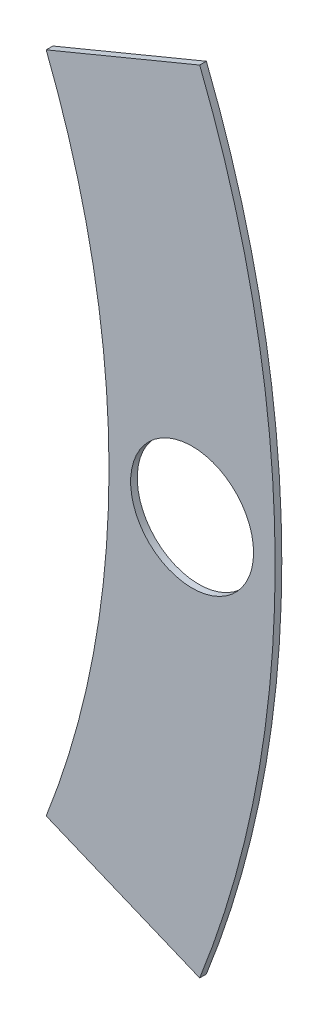
ISO-10303-21;
HEADER;
FILE_DESCRIPTION(('STEP AP214'),'2;1');
FILE_NAME('part.step','',(''),(''),'','','');
FILE_SCHEMA(('AUTOMOTIVE_DESIGN { 1 0 10303 214 1 1 1 1 }'));
ENDSEC;
DATA;
#1=APPLICATION_CONTEXT('core data for automotive mechanical design processes');
#2=APPLICATION_PROTOCOL_DEFINITION('international standard','automotive_design',2000,#1);
#3=PRODUCT_CONTEXT('',#1,'mechanical');
#4=PRODUCT('Part','Part','',(#3));
#5=PRODUCT_RELATED_PRODUCT_CATEGORY('part','',(#4));
#6=PRODUCT_DEFINITION_FORMATION('','',#4);
#7=PRODUCT_DEFINITION_CONTEXT('part definition',#1,'design');
#8=PRODUCT_DEFINITION('design','',#6,#7);
#9=PRODUCT_DEFINITION_SHAPE('','',#8);
#10=(LENGTH_UNIT() NAMED_UNIT(*) SI_UNIT(.MILLI.,.METRE.));
#11=(NAMED_UNIT(*) PLANE_ANGLE_UNIT() SI_UNIT($,.RADIAN.));
#12=(NAMED_UNIT(*) SI_UNIT($,.STERADIAN.) SOLID_ANGLE_UNIT());
#13=UNCERTAINTY_MEASURE_WITH_UNIT(LENGTH_MEASURE(1.E-05),#10,'distance_accuracy_value','');
#14=(GEOMETRIC_REPRESENTATION_CONTEXT(3) GLOBAL_UNCERTAINTY_ASSIGNED_CONTEXT((#13)) GLOBAL_UNIT_ASSIGNED_CONTEXT((#10,
#11,#12)) REPRESENTATION_CONTEXT('',''));
#15=CARTESIAN_POINT('',(0.,0.,0.));
#16=DIRECTION('',(0.,0.,1.));
#17=DIRECTION('',(1.,0.,0.));
#18=AXIS2_PLACEMENT_3D('',#15,#16,#17);
#19=CARTESIAN_POINT('',(0.,0.,0.508));
#20=DIRECTION('',(0.,0.,-1.));
#21=DIRECTION('',(-1.,0.,0.));
#22=AXIS2_PLACEMENT_3D('',#19,#20,#21);
#23=CYLINDRICAL_SURFACE('',#22,82.042);
#24=DIRECTION('',(0.,0.,1.));
#25=VECTOR('',#24,1.);
#26=CARTESIAN_POINT('',(76.2738505429117,-30.2190252549212,0.));
#27=LINE('',#26,#25);
#28=CARTESIAN_POINT('',(76.2738505429117,-30.2190252549212,0.));
#29=VERTEX_POINT('',#28);
#30=CARTESIAN_POINT('',(76.2738505429117,-30.2190252549212,0.508));
#31=VERTEX_POINT('',#30);
#32=EDGE_CURVE('E92',#29,#31,#27,.T.);
#33=ORIENTED_EDGE('',*,*,#32,.F.);
#34=CARTESIAN_POINT('',(0.,0.,0.));
#35=DIRECTION('',(0.,0.,1.));
#36=DIRECTION('',(1.,0.,0.));
#37=AXIS2_PLACEMENT_3D('',#34,#35,#36);
#38=CIRCLE('',#37,82.042);
#39=CARTESIAN_POINT('',(76.2738505429117,30.2190252549212,0.));
#40=VERTEX_POINT('',#39);
#41=EDGE_CURVE('E38',#29,#40,#38,.T.);
#42=ORIENTED_EDGE('',*,*,#41,.T.);
#43=DIRECTION('',(0.,0.,1.));
#44=VECTOR('',#43,1.);
#45=CARTESIAN_POINT('',(76.2738505429117,30.2190252549212,0.));
#46=LINE('',#45,#44);
#47=CARTESIAN_POINT('',(76.2738505429117,30.2190252549212,0.508));
#48=VERTEX_POINT('',#47);
#49=EDGE_CURVE('E73',#40,#48,#46,.T.);
#50=ORIENTED_EDGE('',*,*,#49,.T.);
#51=CARTESIAN_POINT('',(0.,0.,0.508));
#52=DIRECTION('',(0.,0.,1.));
#53=DIRECTION('',(1.,0.,0.));
#54=AXIS2_PLACEMENT_3D('',#51,#52,#53);
#55=CIRCLE('',#54,82.042);
#56=EDGE_CURVE('E12',#31,#48,#55,.T.);
#57=ORIENTED_EDGE('',*,*,#56,.F.);
#58=EDGE_LOOP('',(#33,#42,#50,#57));
#59=FACE_BOUND('',#58,.T.);
#60=ADVANCED_FACE('F35',(#59),#23,.T.);
#61=CARTESIAN_POINT('',(0.,0.,0.508));
#62=DIRECTION('',(0.,0.,1.));
#63=DIRECTION('',(1.,0.,0.));
#64=AXIS2_PLACEMENT_3D('',#61,#62,#63);
#65=PLANE('',#64);
#66=CARTESIAN_POINT('',(75.692,0.,0.508));
#67=DIRECTION('',(0.,0.,1.));
#68=DIRECTION('',(1.,0.,0.));
#69=AXIS2_PLACEMENT_3D('',#66,#67,#68);
#70=CIRCLE('',#69,4.69899999999999);
#71=CARTESIAN_POINT('',(80.391,0.,0.508));
#72=VERTEX_POINT('',#71);
#73=EDGE_CURVE('E99',#72,#72,#70,.T.);
#74=ORIENTED_EDGE('',*,*,#73,.F.);
#75=EDGE_LOOP('',(#74));
#76=FACE_BOUND('',#75,.T.);
#77=CARTESIAN_POINT('',(0.,0.,0.508));
#78=DIRECTION('',(0.,0.,1.));
#79=DIRECTION('',(1.,0.,0.));
#80=AXIS2_PLACEMENT_3D('',#77,#78,#79);
#81=CIRCLE('',#80,69.342);
#82=CARTESIAN_POINT('',(64.5389168484906,-25.358256565143,0.508));
#83=VERTEX_POINT('',#82);
#84=CARTESIAN_POINT('',(64.5389168484906,25.358256565143,0.508));
#85=VERTEX_POINT('',#84);
#86=EDGE_CURVE('E93',#83,#85,#81,.T.);
#87=ORIENTED_EDGE('',*,*,#86,.F.);
#88=DIRECTION('',(0.923879532511286,-0.382683432365091,0.));
#89=VECTOR('',#88,1.);
#90=CARTESIAN_POINT('',(64.5389168484906,-25.358256565143,0.508));
#91=LINE('',#90,#89);
#92=EDGE_CURVE('E49',#83,#31,#91,.T.);
#93=ORIENTED_EDGE('',*,*,#92,.T.);
#94=ORIENTED_EDGE('',*,*,#56,.T.);
#95=DIRECTION('',(-0.923879532511286,-0.38268343236509,0.));
#96=VECTOR('',#95,1.);
#97=CARTESIAN_POINT('',(64.5389168484906,25.358256565143,0.508));
#98=LINE('',#97,#96);
#99=EDGE_CURVE('E76',#48,#85,#98,.T.);
#100=ORIENTED_EDGE('',*,*,#99,.T.);
#101=EDGE_LOOP('',(#87,#93,#94,#100));
#102=FACE_BOUND('',#101,.T.);
#103=ADVANCED_FACE('F115',(#76,#102),#65,.T.);
#104=CARTESIAN_POINT('',(0.,0.,0.));
#105=DIRECTION('',(0.,0.,1.));
#106=DIRECTION('',(1.,0.,0.));
#107=AXIS2_PLACEMENT_3D('',#104,#105,#106);
#108=PLANE('',#107);
#109=CARTESIAN_POINT('',(75.692,0.,0.));
#110=DIRECTION('',(0.,0.,1.));
#111=DIRECTION('',(1.,0.,0.));
#112=AXIS2_PLACEMENT_3D('',#109,#110,#111);
#113=CIRCLE('',#112,4.69899999999999);
#114=CARTESIAN_POINT('',(80.391,0.,0.));
#115=VERTEX_POINT('',#114);
#116=EDGE_CURVE('E96',#115,#115,#113,.T.);
#117=ORIENTED_EDGE('',*,*,#116,.T.);
#118=EDGE_LOOP('',(#117));
#119=FACE_BOUND('',#118,.T.);
#120=DIRECTION('',(0.923879532511286,-0.382683432365091,0.));
#121=VECTOR('',#120,1.);
#122=CARTESIAN_POINT('',(64.5389168484906,-25.358256565143,0.));
#123=LINE('',#122,#121);
#124=CARTESIAN_POINT('',(64.5389168484906,-25.358256565143,0.));
#125=VERTEX_POINT('',#124);
#126=EDGE_CURVE('E81',#125,#29,#123,.T.);
#127=ORIENTED_EDGE('',*,*,#126,.F.);
#128=CARTESIAN_POINT('',(0.,0.,0.));
#129=DIRECTION('',(0.,0.,1.));
#130=DIRECTION('',(1.,0.,0.));
#131=AXIS2_PLACEMENT_3D('',#128,#129,#130);
#132=CIRCLE('',#131,69.342);
#133=CARTESIAN_POINT('',(64.5389168484906,25.358256565143,0.));
#134=VERTEX_POINT('',#133);
#135=EDGE_CURVE('E89',#125,#134,#132,.T.);
#136=ORIENTED_EDGE('',*,*,#135,.T.);
#137=DIRECTION('',(-0.923879532511286,-0.38268343236509,0.));
#138=VECTOR('',#137,1.);
#139=CARTESIAN_POINT('',(64.5389168484906,25.358256565143,0.));
#140=LINE('',#139,#138);
#141=EDGE_CURVE('E57',#40,#134,#140,.T.);
#142=ORIENTED_EDGE('',*,*,#141,.F.);
#143=ORIENTED_EDGE('',*,*,#41,.F.);
#144=EDGE_LOOP('',(#127,#136,#142,#143));
#145=FACE_BOUND('',#144,.T.);
#146=ADVANCED_FACE('F87',(#119,#145),#108,.F.);
#147=CARTESIAN_POINT('',(0.,0.,0.));
#148=DIRECTION('',(0.,0.,1.));
#149=DIRECTION('',(1.,0.,0.));
#150=AXIS2_PLACEMENT_3D('',#147,#148,#149);
#151=CYLINDRICAL_SURFACE('',#150,69.342);
#152=DIRECTION('',(0.,0.,1.));
#153=VECTOR('',#152,1.);
#154=CARTESIAN_POINT('',(64.5389168484906,-25.358256565143,0.));
#155=LINE('',#154,#153);
#156=EDGE_CURVE('E105',#125,#83,#155,.T.);
#157=ORIENTED_EDGE('',*,*,#156,.T.);
#158=ORIENTED_EDGE('',*,*,#86,.T.);
#159=DIRECTION('',(0.,0.,1.));
#160=VECTOR('',#159,1.);
#161=CARTESIAN_POINT('',(64.5389168484906,25.358256565143,0.));
#162=LINE('',#161,#160);
#163=EDGE_CURVE('E80',#134,#85,#162,.T.);
#164=ORIENTED_EDGE('',*,*,#163,.F.);
#165=ORIENTED_EDGE('',*,*,#135,.F.);
#166=EDGE_LOOP('',(#157,#158,#164,#165));
#167=FACE_BOUND('',#166,.T.);
#168=ADVANCED_FACE('F112',(#167),#151,.F.);
#169=CARTESIAN_POINT('',(75.692,0.,0.));
#170=DIRECTION('',(0.,0.,1.));
#171=DIRECTION('',(1.,0.,0.));
#172=AXIS2_PLACEMENT_3D('',#169,#170,#171);
#173=CYLINDRICAL_SURFACE('',#172,4.69899999999999);
#174=ORIENTED_EDGE('',*,*,#116,.F.);
#175=EDGE_LOOP('',(#174));
#176=FACE_BOUND('',#175,.T.);
#177=ORIENTED_EDGE('',*,*,#73,.T.);
#178=EDGE_LOOP('',(#177));
#179=FACE_BOUND('',#178,.T.);
#180=ADVANCED_FACE('F128',(#176,#179),#173,.F.);
#181=CARTESIAN_POINT('',(64.5389168484906,25.358256565143,0.));
#182=DIRECTION('',(-0.38268343236509,0.923879532511287,0.));
#183=DIRECTION('',(-0.923879532511287,-0.38268343236509,0.));
#184=AXIS2_PLACEMENT_3D('',#181,#182,#183);
#185=PLANE('',#184);
#186=ORIENTED_EDGE('',*,*,#99,.F.);
#187=ORIENTED_EDGE('',*,*,#49,.F.);
#188=ORIENTED_EDGE('',*,*,#141,.T.);
#189=ORIENTED_EDGE('',*,*,#163,.T.);
#190=EDGE_LOOP('',(#186,#187,#188,#189));
#191=FACE_BOUND('',#190,.T.);
#192=ADVANCED_FACE('F74',(#191),#185,.T.);
#193=CARTESIAN_POINT('',(64.5389168484906,-25.358256565143,0.));
#194=DIRECTION('',(-0.382683432365091,-0.923879532511287,0.));
#195=DIRECTION('',(0.923879532511287,-0.382683432365091,0.));
#196=AXIS2_PLACEMENT_3D('',#193,#194,#195);
#197=PLANE('',#196);
#198=ORIENTED_EDGE('',*,*,#92,.F.);
#199=ORIENTED_EDGE('',*,*,#156,.F.);
#200=ORIENTED_EDGE('',*,*,#126,.T.);
#201=ORIENTED_EDGE('',*,*,#32,.T.);
#202=EDGE_LOOP('',(#198,#199,#200,#201));
#203=FACE_BOUND('',#202,.T.);
#204=ADVANCED_FACE('F110',(#203),#197,.T.);
#205=CLOSED_SHELL('',(#60,#103,#146,#168,#180,#192,#204));
#206=MANIFOLD_SOLID_BREP('B2',#205);
#207=ADVANCED_BREP_SHAPE_REPRESENTATION('',(#18,#206),#14);
#208=SHAPE_DEFINITION_REPRESENTATION(#9,#207);
ENDSEC;
END-ISO-10303-21;
